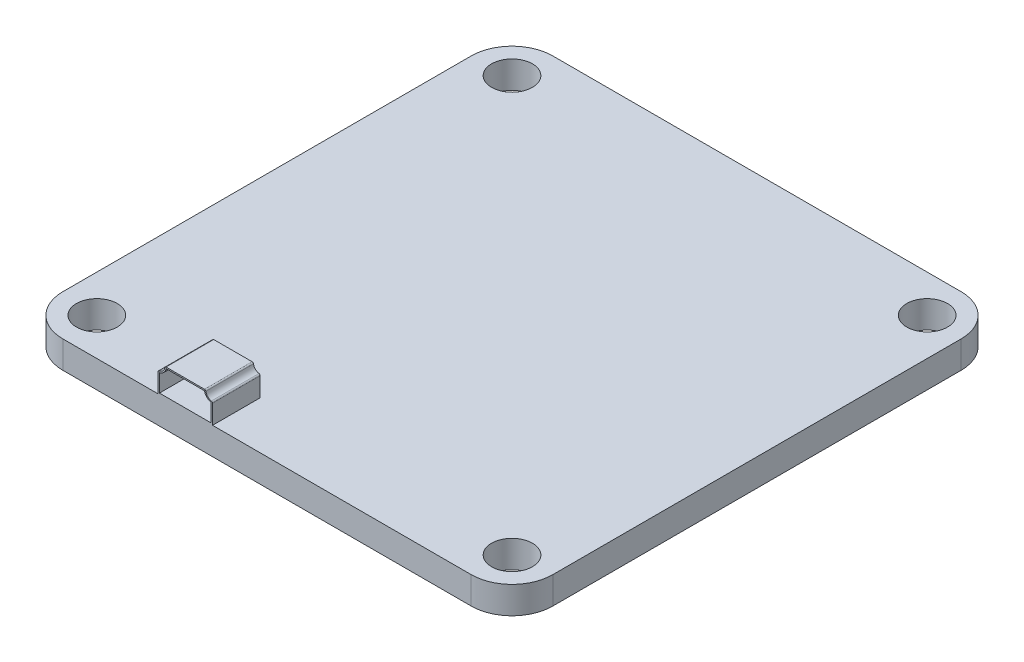
ISO-10303-21;
HEADER;
FILE_DESCRIPTION(('STEP AP214'),'2;1');
FILE_NAME('part.step','',(''),(''),'','','');
FILE_SCHEMA(('AUTOMOTIVE_DESIGN { 1 0 10303 214 1 1 1 1 }'));
ENDSEC;
DATA;
#1=APPLICATION_CONTEXT('core data for automotive mechanical design processes');
#2=APPLICATION_PROTOCOL_DEFINITION('international standard','automotive_design',2000,#1);
#3=PRODUCT_CONTEXT('',#1,'mechanical');
#4=PRODUCT('Part','Part','',(#3));
#5=PRODUCT_RELATED_PRODUCT_CATEGORY('part','',(#4));
#6=PRODUCT_DEFINITION_FORMATION('','',#4);
#7=PRODUCT_DEFINITION_CONTEXT('part definition',#1,'design');
#8=PRODUCT_DEFINITION('design','',#6,#7);
#9=PRODUCT_DEFINITION_SHAPE('','',#8);
#10=(LENGTH_UNIT() NAMED_UNIT(*) SI_UNIT(.MILLI.,.METRE.));
#11=(NAMED_UNIT(*) PLANE_ANGLE_UNIT() SI_UNIT($,.RADIAN.));
#12=(NAMED_UNIT(*) SI_UNIT($,.STERADIAN.) SOLID_ANGLE_UNIT());
#13=UNCERTAINTY_MEASURE_WITH_UNIT(LENGTH_MEASURE(1.E-05),#10,'distance_accuracy_value','');
#14=(GEOMETRIC_REPRESENTATION_CONTEXT(3) GLOBAL_UNCERTAINTY_ASSIGNED_CONTEXT((#13)) GLOBAL_UNIT_ASSIGNED_CONTEXT((#10,
#11,#12)) REPRESENTATION_CONTEXT('',''));
#15=CARTESIAN_POINT('',(0.,0.,0.));
#16=DIRECTION('',(0.,0.,1.));
#17=DIRECTION('',(1.,0.,0.));
#18=AXIS2_PLACEMENT_3D('',#15,#16,#17);
#19=CARTESIAN_POINT('',(-7.40839202169003,2.9,14.5));
#20=DIRECTION('',(0.,1.,0.));
#21=DIRECTION('',(0.,0.,1.));
#22=AXIS2_PLACEMENT_3D('',#19,#20,#21);
#23=PLANE('',#22);
#24=DIRECTION('',(-1.,0.,0.));
#25=VECTOR('',#24,1.);
#26=CARTESIAN_POINT('',(-7.40839202169003,2.9,15.));
#27=LINE('',#26,#25);
#28=CARTESIAN_POINT('',(-4.59160797830996,2.9,15.));
#29=VERTEX_POINT('',#28);
#30=CARTESIAN_POINT('',(-7.40839202169003,2.9,15.));
#31=VERTEX_POINT('',#30);
#32=EDGE_CURVE('E55',#29,#31,#27,.T.);
#33=ORIENTED_EDGE('',*,*,#32,.F.);
#34=DIRECTION('',(0.,0.,1.));
#35=VECTOR('',#34,1.);
#36=CARTESIAN_POINT('',(-4.59160797830996,2.9,14.5));
#37=LINE('',#36,#35);
#38=CARTESIAN_POINT('',(-4.59160797830996,2.9,18.));
#39=VERTEX_POINT('',#38);
#40=EDGE_CURVE('E253',#29,#39,#37,.T.);
#41=ORIENTED_EDGE('',*,*,#40,.T.);
#42=DIRECTION('',(-1.,0.,0.));
#43=VECTOR('',#42,1.);
#44=CARTESIAN_POINT('',(-7.40839202169003,2.9,18.));
#45=LINE('',#44,#43);
#46=CARTESIAN_POINT('',(-7.40839202169003,2.9,18.));
#47=VERTEX_POINT('',#46);
#48=EDGE_CURVE('E226',#39,#47,#45,.T.);
#49=ORIENTED_EDGE('',*,*,#48,.T.);
#50=DIRECTION('',(0.,0.,1.));
#51=VECTOR('',#50,1.);
#52=CARTESIAN_POINT('',(-7.40839202169003,2.9,14.5));
#53=LINE('',#52,#51);
#54=EDGE_CURVE('E211',#31,#47,#53,.T.);
#55=ORIENTED_EDGE('',*,*,#54,.F.);
#56=EDGE_LOOP('',(#33,#41,#49,#55));
#57=FACE_BOUND('',#56,.T.);
#58=ADVANCED_FACE('F39',(#57),#23,.F.);
#59=CARTESIAN_POINT('',(-3.99999999999999,3.,14.5));
#60=DIRECTION('',(0.,0.,1.));
#61=DIRECTION('',(1.,0.,0.));
#62=AXIS2_PLACEMENT_3D('',#59,#60,#61);
#63=CYLINDRICAL_SURFACE('',#62,0.6);
#64=CARTESIAN_POINT('',(-3.99999999999999,3.,15.));
#65=DIRECTION('',(0.,0.,-1.));
#66=DIRECTION('',(-1.,0.,0.));
#67=AXIS2_PLACEMENT_3D('',#64,#65,#66);
#68=CIRCLE('',#67,0.6);
#69=CARTESIAN_POINT('',(-4.1,2.40839202169004,15.));
#70=VERTEX_POINT('',#69);
#71=EDGE_CURVE('E62',#70,#29,#68,.T.);
#72=ORIENTED_EDGE('',*,*,#71,.F.);
#73=DIRECTION('',(0.,0.,1.));
#74=VECTOR('',#73,1.);
#75=CARTESIAN_POINT('',(-4.1,2.40839202169004,14.5));
#76=LINE('',#75,#74);
#77=CARTESIAN_POINT('',(-4.1,2.40839202169004,18.));
#78=VERTEX_POINT('',#77);
#79=EDGE_CURVE('E257',#70,#78,#76,.T.);
#80=ORIENTED_EDGE('',*,*,#79,.T.);
#81=CARTESIAN_POINT('',(-3.99999999999999,3.,18.));
#82=DIRECTION('',(0.,0.,-1.));
#83=DIRECTION('',(1.,0.,0.));
#84=AXIS2_PLACEMENT_3D('',#81,#82,#83);
#85=CIRCLE('',#84,0.6);
#86=EDGE_CURVE('E249',#78,#39,#85,.T.);
#87=ORIENTED_EDGE('',*,*,#86,.T.);
#88=ORIENTED_EDGE('',*,*,#40,.F.);
#89=EDGE_LOOP('',(#72,#80,#87,#88));
#90=FACE_BOUND('',#89,.T.);
#91=ADVANCED_FACE('F574',(#90),#63,.T.);
#92=CARTESIAN_POINT('',(-4.1,1.1,14.5));
#93=DIRECTION('',(1.,0.,0.));
#94=DIRECTION('',(0.,1.,0.));
#95=AXIS2_PLACEMENT_3D('',#92,#93,#94);
#96=PLANE('',#95);
#97=DIRECTION('',(0.,1.,0.));
#98=VECTOR('',#97,1.);
#99=CARTESIAN_POINT('',(-4.1,1.1,15.));
#100=LINE('',#99,#98);
#101=CARTESIAN_POINT('',(-4.1,1.1,15.));
#102=VERTEX_POINT('',#101);
#103=EDGE_CURVE('E232',#102,#70,#100,.T.);
#104=ORIENTED_EDGE('',*,*,#103,.F.);
#105=DIRECTION('',(0.,0.,1.));
#106=VECTOR('',#105,1.);
#107=CARTESIAN_POINT('',(-4.1,1.1,14.5));
#108=LINE('',#107,#106);
#109=CARTESIAN_POINT('',(-4.1,1.1,18.));
#110=VERTEX_POINT('',#109);
#111=EDGE_CURVE('E260',#102,#110,#108,.T.);
#112=ORIENTED_EDGE('',*,*,#111,.T.);
#113=DIRECTION('',(0.,1.,0.));
#114=VECTOR('',#113,1.);
#115=CARTESIAN_POINT('',(-4.1,1.1,18.));
#116=LINE('',#115,#114);
#117=EDGE_CURVE('E245',#110,#78,#116,.T.);
#118=ORIENTED_EDGE('',*,*,#117,.T.);
#119=ORIENTED_EDGE('',*,*,#79,.F.);
#120=EDGE_LOOP('',(#104,#112,#118,#119));
#121=FACE_BOUND('',#120,.T.);
#122=ADVANCED_FACE('F579',(#121),#96,.F.);
#123=CARTESIAN_POINT('',(-7.9,1.1,14.5));
#124=DIRECTION('',(0.,-1.,0.));
#125=DIRECTION('',(0.,0.,-1.));
#126=AXIS2_PLACEMENT_3D('',#123,#124,#125);
#127=PLANE('',#126);
#128=DIRECTION('',(1.,0.,0.));
#129=VECTOR('',#128,1.);
#130=CARTESIAN_POINT('',(-7.9,1.1,15.));
#131=LINE('',#130,#129);
#132=CARTESIAN_POINT('',(-7.9,1.1,15.));
#133=VERTEX_POINT('',#132);
#134=EDGE_CURVE('E220',#133,#102,#131,.T.);
#135=ORIENTED_EDGE('',*,*,#134,.F.);
#136=DIRECTION('',(0.,0.,1.));
#137=VECTOR('',#136,1.);
#138=CARTESIAN_POINT('',(-7.9,1.1,14.5));
#139=LINE('',#138,#137);
#140=CARTESIAN_POINT('',(-7.9,1.1,18.));
#141=VERTEX_POINT('',#140);
#142=EDGE_CURVE('E210',#133,#141,#139,.T.);
#143=ORIENTED_EDGE('',*,*,#142,.T.);
#144=DIRECTION('',(1.,0.,0.));
#145=VECTOR('',#144,1.);
#146=CARTESIAN_POINT('',(-7.9,1.1,18.));
#147=LINE('',#146,#145);
#148=EDGE_CURVE('E241',#141,#110,#147,.T.);
#149=ORIENTED_EDGE('',*,*,#148,.T.);
#150=ORIENTED_EDGE('',*,*,#111,.F.);
#151=EDGE_LOOP('',(#135,#143,#149,#150));
#152=FACE_BOUND('',#151,.T.);
#153=ADVANCED_FACE('F760',(#152),#127,.F.);
#154=CARTESIAN_POINT('',(-7.9,1.1,14.5));
#155=DIRECTION('',(-1.,0.,0.));
#156=DIRECTION('',(0.,0.,1.));
#157=AXIS2_PLACEMENT_3D('',#154,#155,#156);
#158=PLANE('',#157);
#159=DIRECTION('',(0.,-1.,0.));
#160=VECTOR('',#159,1.);
#161=CARTESIAN_POINT('',(-7.9,1.1,15.));
#162=LINE('',#161,#160);
#163=CARTESIAN_POINT('',(-7.9,2.40839202169004,15.));
#164=VERTEX_POINT('',#163);
#165=EDGE_CURVE('E215',#164,#133,#162,.T.);
#166=ORIENTED_EDGE('',*,*,#165,.F.);
#167=DIRECTION('',(0.,0.,1.));
#168=VECTOR('',#167,1.);
#169=CARTESIAN_POINT('',(-7.9,2.40839202169004,14.5));
#170=LINE('',#169,#168);
#171=CARTESIAN_POINT('',(-7.9,2.40839202169004,18.));
#172=VERTEX_POINT('',#171);
#173=EDGE_CURVE('E201',#164,#172,#170,.T.);
#174=ORIENTED_EDGE('',*,*,#173,.T.);
#175=DIRECTION('',(0.,-1.,0.));
#176=VECTOR('',#175,1.);
#177=CARTESIAN_POINT('',(-7.9,1.1,18.));
#178=LINE('',#177,#176);
#179=EDGE_CURVE('E238',#172,#141,#178,.T.);
#180=ORIENTED_EDGE('',*,*,#179,.T.);
#181=ORIENTED_EDGE('',*,*,#142,.F.);
#182=EDGE_LOOP('',(#166,#174,#180,#181));
#183=FACE_BOUND('',#182,.T.);
#184=ADVANCED_FACE('F216',(#183),#158,.F.);
#185=CARTESIAN_POINT('',(-7.99999999999999,3.,14.5));
#186=DIRECTION('',(0.,0.,1.));
#187=DIRECTION('',(1.,0.,0.));
#188=AXIS2_PLACEMENT_3D('',#185,#186,#187);
#189=CYLINDRICAL_SURFACE('',#188,0.6);
#190=CARTESIAN_POINT('',(-7.99999999999999,3.,15.));
#191=DIRECTION('',(0.,0.,-1.));
#192=DIRECTION('',(-1.,0.,0.));
#193=AXIS2_PLACEMENT_3D('',#190,#191,#192);
#194=CIRCLE('',#193,0.6);
#195=EDGE_CURVE('E11',#31,#164,#194,.T.);
#196=ORIENTED_EDGE('',*,*,#195,.F.);
#197=ORIENTED_EDGE('',*,*,#54,.T.);
#198=CARTESIAN_POINT('',(-7.99999999999999,3.,18.));
#199=DIRECTION('',(0.,0.,-1.));
#200=DIRECTION('',(1.,0.,0.));
#201=AXIS2_PLACEMENT_3D('',#198,#199,#200);
#202=CIRCLE('',#201,0.6);
#203=EDGE_CURVE('E205',#47,#172,#202,.T.);
#204=ORIENTED_EDGE('',*,*,#203,.T.);
#205=ORIENTED_EDGE('',*,*,#173,.F.);
#206=EDGE_LOOP('',(#196,#197,#204,#205));
#207=FACE_BOUND('',#206,.T.);
#208=ADVANCED_FACE('F203',(#207),#189,.T.);
#209=CARTESIAN_POINT('',(-15.,1.,15.));
#210=DIRECTION('',(0.,-1.,0.));
#211=DIRECTION('',(0.,0.,-1.));
#212=AXIS2_PLACEMENT_3D('',#209,#210,#211);
#213=PLANE('',#212);
#214=CARTESIAN_POINT('',(-15.25,1.,15.25));
#215=DIRECTION('',(0.,1.,0.));
#216=DIRECTION('',(0.,0.,1.));
#217=AXIS2_PLACEMENT_3D('',#214,#215,#216);
#218=CIRCLE('',#217,1.5);
#219=CARTESIAN_POINT('',(-15.25,1.,16.75));
#220=VERTEX_POINT('',#219);
#221=EDGE_CURVE('E373',#220,#220,#218,.T.);
#222=ORIENTED_EDGE('',*,*,#221,.F.);
#223=EDGE_LOOP('',(#222));
#224=FACE_BOUND('',#223,.T.);
#225=CARTESIAN_POINT('',(15.25,1.,15.25));
#226=DIRECTION('',(0.,1.,0.));
#227=DIRECTION('',(0.,0.,-1.));
#228=AXIS2_PLACEMENT_3D('',#225,#226,#227);
#229=CIRCLE('',#228,1.5);
#230=CARTESIAN_POINT('',(15.25,1.,13.75));
#231=VERTEX_POINT('',#230);
#232=EDGE_CURVE('E381',#231,#231,#229,.T.);
#233=ORIENTED_EDGE('',*,*,#232,.F.);
#234=EDGE_LOOP('',(#233));
#235=FACE_BOUND('',#234,.T.);
#236=CARTESIAN_POINT('',(-15.25,1.,-15.25));
#237=DIRECTION('',(0.,1.,0.));
#238=DIRECTION('',(0.,0.,-1.));
#239=AXIS2_PLACEMENT_3D('',#236,#237,#238);
#240=CIRCLE('',#239,1.5);
#241=CARTESIAN_POINT('',(-15.25,1.,-16.75));
#242=VERTEX_POINT('',#241);
#243=EDGE_CURVE('E389',#242,#242,#240,.T.);
#244=ORIENTED_EDGE('',*,*,#243,.F.);
#245=EDGE_LOOP('',(#244));
#246=FACE_BOUND('',#245,.T.);
#247=CARTESIAN_POINT('',(15.25,1.,-15.25));
#248=DIRECTION('',(0.,1.,0.));
#249=DIRECTION('',(0.,0.,1.));
#250=AXIS2_PLACEMENT_3D('',#247,#248,#249);
#251=CIRCLE('',#250,1.5);
#252=CARTESIAN_POINT('',(15.25,1.,-13.75));
#253=VERTEX_POINT('',#252);
#254=EDGE_CURVE('E397',#253,#253,#251,.T.);
#255=ORIENTED_EDGE('',*,*,#254,.F.);
#256=EDGE_LOOP('',(#255));
#257=FACE_BOUND('',#256,.T.);
#258=DIRECTION('',(0.,0.,1.));
#259=VECTOR('',#258,1.);
#260=CARTESIAN_POINT('',(-7.99999999999999,1.,14.5));
#261=LINE('',#260,#259);
#262=CARTESIAN_POINT('',(-7.99999999999999,1.,14.5));
#263=VERTEX_POINT('',#262);
#264=CARTESIAN_POINT('',(-7.99999999999999,1.,18.));
#265=VERTEX_POINT('',#264);
#266=EDGE_CURVE('E308',#263,#265,#261,.T.);
#267=ORIENTED_EDGE('',*,*,#266,.F.);
#268=DIRECTION('',(1.,0.,0.));
#269=VECTOR('',#268,1.);
#270=CARTESIAN_POINT('',(-7.99999999999999,1.,14.5));
#271=LINE('',#270,#269);
#272=CARTESIAN_POINT('',(-3.99999999999999,1.,14.5));
#273=VERTEX_POINT('',#272);
#274=EDGE_CURVE('E271',#263,#273,#271,.T.);
#275=ORIENTED_EDGE('',*,*,#274,.T.);
#276=DIRECTION('',(0.,0.,1.));
#277=VECTOR('',#276,1.);
#278=CARTESIAN_POINT('',(-3.99999999999999,1.,14.5));
#279=LINE('',#278,#277);
#280=CARTESIAN_POINT('',(-3.99999999999999,1.,18.));
#281=VERTEX_POINT('',#280);
#282=EDGE_CURVE('E368',#273,#281,#279,.T.);
#283=ORIENTED_EDGE('',*,*,#282,.T.);
#284=DIRECTION('',(1.,0.,0.));
#285=VECTOR('',#284,1.);
#286=CARTESIAN_POINT('',(-15.,1.,18.));
#287=LINE('',#286,#285);
#288=CARTESIAN_POINT('',(15.,1.,18.));
#289=VERTEX_POINT('',#288);
#290=EDGE_CURVE('E409',#281,#289,#287,.T.);
#291=ORIENTED_EDGE('',*,*,#290,.T.);
#292=CARTESIAN_POINT('',(15.,1.,15.));
#293=DIRECTION('',(0.,1.,0.));
#294=DIRECTION('',(0.,0.,1.));
#295=AXIS2_PLACEMENT_3D('',#292,#293,#294);
#296=CIRCLE('',#295,3.);
#297=CARTESIAN_POINT('',(18.,1.,15.));
#298=VERTEX_POINT('',#297);
#299=EDGE_CURVE('E415',#289,#298,#296,.T.);
#300=ORIENTED_EDGE('',*,*,#299,.T.);
#301=DIRECTION('',(0.,0.,-1.));
#302=VECTOR('',#301,1.);
#303=CARTESIAN_POINT('',(18.,1.,15.));
#304=LINE('',#303,#302);
#305=CARTESIAN_POINT('',(18.,1.,-15.));
#306=VERTEX_POINT('',#305);
#307=EDGE_CURVE('E418',#298,#306,#304,.T.);
#308=ORIENTED_EDGE('',*,*,#307,.T.);
#309=CARTESIAN_POINT('',(15.,1.,-15.));
#310=DIRECTION('',(0.,1.,0.));
#311=DIRECTION('',(0.,0.,-1.));
#312=AXIS2_PLACEMENT_3D('',#309,#310,#311);
#313=CIRCLE('',#312,3.);
#314=CARTESIAN_POINT('',(15.,1.,-18.));
#315=VERTEX_POINT('',#314);
#316=EDGE_CURVE('E421',#306,#315,#313,.T.);
#317=ORIENTED_EDGE('',*,*,#316,.T.);
#318=DIRECTION('',(-1.,0.,0.));
#319=VECTOR('',#318,1.);
#320=CARTESIAN_POINT('',(-15.,1.,-18.));
#321=LINE('',#320,#319);
#322=CARTESIAN_POINT('',(-15.,1.,-18.));
#323=VERTEX_POINT('',#322);
#324=EDGE_CURVE('E424',#315,#323,#321,.T.);
#325=ORIENTED_EDGE('',*,*,#324,.T.);
#326=CARTESIAN_POINT('',(-15.,1.,-15.));
#327=DIRECTION('',(0.,1.,0.));
#328=DIRECTION('',(0.,0.,-1.));
#329=AXIS2_PLACEMENT_3D('',#326,#327,#328);
#330=CIRCLE('',#329,3.);
#331=CARTESIAN_POINT('',(-18.,1.,-15.));
#332=VERTEX_POINT('',#331);
#333=EDGE_CURVE('E427',#323,#332,#330,.T.);
#334=ORIENTED_EDGE('',*,*,#333,.T.);
#335=DIRECTION('',(0.,0.,1.));
#336=VECTOR('',#335,1.);
#337=CARTESIAN_POINT('',(-18.,1.,15.));
#338=LINE('',#337,#336);
#339=CARTESIAN_POINT('',(-18.,1.,15.));
#340=VERTEX_POINT('',#339);
#341=EDGE_CURVE('E430',#332,#340,#338,.T.);
#342=ORIENTED_EDGE('',*,*,#341,.T.);
#343=CARTESIAN_POINT('',(-15.,1.,15.));
#344=DIRECTION('',(0.,1.,0.));
#345=DIRECTION('',(0.,0.,-1.));
#346=AXIS2_PLACEMENT_3D('',#343,#344,#345);
#347=CIRCLE('',#346,3.);
#348=CARTESIAN_POINT('',(-15.,1.,18.));
#349=VERTEX_POINT('',#348);
#350=EDGE_CURVE('E405',#340,#349,#347,.T.);
#351=ORIENTED_EDGE('',*,*,#350,.T.);
#352=EDGE_CURVE('E411',#349,#265,#287,.T.);
#353=ORIENTED_EDGE('',*,*,#352,.T.);
#354=EDGE_LOOP('',(#267,#275,#283,#291,#300,#308,#317,#325,#334,#342,#351,#353));
#355=FACE_BOUND('',#354,.T.);
#356=ADVANCED_FACE('F513',(#224,#235,#246,#257,#355),#213,.F.);
#357=CARTESIAN_POINT('',(-15.,-1.,15.));
#358=DIRECTION('',(0.,-1.,0.));
#359=DIRECTION('',(0.,0.,-1.));
#360=AXIS2_PLACEMENT_3D('',#357,#358,#359);
#361=PLANE('',#360);
#362=CARTESIAN_POINT('',(15.25,-1.,15.25));
#363=DIRECTION('',(0.,1.,0.));
#364=DIRECTION('',(0.,0.,-1.));
#365=AXIS2_PLACEMENT_3D('',#362,#363,#364);
#366=CIRCLE('',#365,1.5);
#367=CARTESIAN_POINT('',(15.25,-1.,13.75));
#368=VERTEX_POINT('',#367);
#369=EDGE_CURVE('E377',#368,#368,#366,.T.);
#370=ORIENTED_EDGE('',*,*,#369,.T.);
#371=EDGE_LOOP('',(#370));
#372=FACE_BOUND('',#371,.T.);
#373=CARTESIAN_POINT('',(15.25,-1.,-15.25));
#374=DIRECTION('',(0.,1.,0.));
#375=DIRECTION('',(0.,0.,1.));
#376=AXIS2_PLACEMENT_3D('',#373,#374,#375);
#377=CIRCLE('',#376,1.5);
#378=CARTESIAN_POINT('',(15.25,-1.,-13.75));
#379=VERTEX_POINT('',#378);
#380=EDGE_CURVE('E393',#379,#379,#377,.T.);
#381=ORIENTED_EDGE('',*,*,#380,.T.);
#382=EDGE_LOOP('',(#381));
#383=FACE_BOUND('',#382,.T.);
#384=CARTESIAN_POINT('',(-15.,-1.,15.));
#385=DIRECTION('',(0.,1.,0.));
#386=DIRECTION('',(0.,0.,-1.));
#387=AXIS2_PLACEMENT_3D('',#384,#385,#386);
#388=CIRCLE('',#387,3.);
#389=CARTESIAN_POINT('',(-18.,-1.,15.));
#390=VERTEX_POINT('',#389);
#391=CARTESIAN_POINT('',(-15.,-1.,18.));
#392=VERTEX_POINT('',#391);
#393=EDGE_CURVE('E401',#390,#392,#388,.T.);
#394=ORIENTED_EDGE('',*,*,#393,.F.);
#395=DIRECTION('',(0.,0.,1.));
#396=VECTOR('',#395,1.);
#397=CARTESIAN_POINT('',(-18.,-1.,15.));
#398=LINE('',#397,#396);
#399=CARTESIAN_POINT('',(-18.,-1.,-15.));
#400=VERTEX_POINT('',#399);
#401=EDGE_CURVE('E410',#400,#390,#398,.T.);
#402=ORIENTED_EDGE('',*,*,#401,.F.);
#403=CARTESIAN_POINT('',(-15.,-1.,-15.));
#404=DIRECTION('',(0.,1.,0.));
#405=DIRECTION('',(0.,0.,-1.));
#406=AXIS2_PLACEMENT_3D('',#403,#404,#405);
#407=CIRCLE('',#406,3.);
#408=CARTESIAN_POINT('',(-15.,-1.,-18.));
#409=VERTEX_POINT('',#408);
#410=EDGE_CURVE('E452',#409,#400,#407,.T.);
#411=ORIENTED_EDGE('',*,*,#410,.F.);
#412=DIRECTION('',(-1.,0.,0.));
#413=VECTOR('',#412,1.);
#414=CARTESIAN_POINT('',(-15.,-1.,-18.));
#415=LINE('',#414,#413);
#416=CARTESIAN_POINT('',(15.,-1.,-18.));
#417=VERTEX_POINT('',#416);
#418=EDGE_CURVE('E449',#417,#409,#415,.T.);
#419=ORIENTED_EDGE('',*,*,#418,.F.);
#420=CARTESIAN_POINT('',(15.,-1.,-15.));
#421=DIRECTION('',(0.,1.,0.));
#422=DIRECTION('',(0.,0.,-1.));
#423=AXIS2_PLACEMENT_3D('',#420,#421,#422);
#424=CIRCLE('',#423,3.);
#425=CARTESIAN_POINT('',(18.,-1.,-15.));
#426=VERTEX_POINT('',#425);
#427=EDGE_CURVE('E446',#426,#417,#424,.T.);
#428=ORIENTED_EDGE('',*,*,#427,.F.);
#429=DIRECTION('',(0.,0.,-1.));
#430=VECTOR('',#429,1.);
#431=CARTESIAN_POINT('',(18.,-1.,15.));
#432=LINE('',#431,#430);
#433=CARTESIAN_POINT('',(18.,-1.,15.));
#434=VERTEX_POINT('',#433);
#435=EDGE_CURVE('E443',#434,#426,#432,.T.);
#436=ORIENTED_EDGE('',*,*,#435,.F.);
#437=CARTESIAN_POINT('',(15.,-1.,15.));
#438=DIRECTION('',(0.,1.,0.));
#439=DIRECTION('',(0.,0.,1.));
#440=AXIS2_PLACEMENT_3D('',#437,#438,#439);
#441=CIRCLE('',#440,3.);
#442=CARTESIAN_POINT('',(15.,-1.,18.));
#443=VERTEX_POINT('',#442);
#444=EDGE_CURVE('E440',#443,#434,#441,.T.);
#445=ORIENTED_EDGE('',*,*,#444,.F.);
#446=DIRECTION('',(1.,0.,0.));
#447=VECTOR('',#446,1.);
#448=CARTESIAN_POINT('',(-15.,-1.,18.));
#449=LINE('',#448,#447);
#450=EDGE_CURVE('E437',#392,#443,#449,.T.);
#451=ORIENTED_EDGE('',*,*,#450,.F.);
#452=EDGE_LOOP('',(#394,#402,#411,#419,#428,#436,#445,#451));
#453=FACE_BOUND('',#452,.T.);
#454=CARTESIAN_POINT('',(-15.25,-1.,-15.25));
#455=DIRECTION('',(0.,1.,0.));
#456=DIRECTION('',(0.,0.,-1.));
#457=AXIS2_PLACEMENT_3D('',#454,#455,#456);
#458=CIRCLE('',#457,1.5);
#459=CARTESIAN_POINT('',(-15.25,-1.,-16.75));
#460=VERTEX_POINT('',#459);
#461=EDGE_CURVE('E385',#460,#460,#458,.T.);
#462=ORIENTED_EDGE('',*,*,#461,.T.);
#463=EDGE_LOOP('',(#462));
#464=FACE_BOUND('',#463,.T.);
#465=CARTESIAN_POINT('',(-15.25,-1.,15.25));
#466=DIRECTION('',(0.,1.,0.));
#467=DIRECTION('',(0.,0.,1.));
#468=AXIS2_PLACEMENT_3D('',#465,#466,#467);
#469=CIRCLE('',#468,1.5);
#470=CARTESIAN_POINT('',(-15.25,-1.,16.75));
#471=VERTEX_POINT('',#470);
#472=EDGE_CURVE('E346',#471,#471,#469,.T.);
#473=ORIENTED_EDGE('',*,*,#472,.T.);
#474=EDGE_LOOP('',(#473));
#475=FACE_BOUND('',#474,.T.);
#476=ADVANCED_FACE('F496',(#372,#383,#453,#464,#475),#361,.T.);
#477=CARTESIAN_POINT('',(-15.,1.,15.));
#478=DIRECTION('',(0.,-1.,0.));
#479=DIRECTION('',(0.,0.,-1.));
#480=AXIS2_PLACEMENT_3D('',#477,#478,#479);
#481=CYLINDRICAL_SURFACE('',#480,3.);
#482=ORIENTED_EDGE('',*,*,#393,.T.);
#483=DIRECTION('',(0.,-1.,0.));
#484=VECTOR('',#483,1.);
#485=CARTESIAN_POINT('',(-15.,1.,18.));
#486=LINE('',#485,#484);
#487=EDGE_CURVE('E48',#349,#392,#486,.T.);
#488=ORIENTED_EDGE('',*,*,#487,.F.);
#489=ORIENTED_EDGE('',*,*,#350,.F.);
#490=DIRECTION('',(0.,-1.,0.));
#491=VECTOR('',#490,1.);
#492=CARTESIAN_POINT('',(-18.,1.,15.));
#493=LINE('',#492,#491);
#494=EDGE_CURVE('E433',#340,#390,#493,.T.);
#495=ORIENTED_EDGE('',*,*,#494,.T.);
#496=EDGE_LOOP('',(#482,#488,#489,#495));
#497=FACE_BOUND('',#496,.T.);
#498=ADVANCED_FACE('F41',(#497),#481,.T.);
#499=CARTESIAN_POINT('',(-15.,1.,18.));
#500=DIRECTION('',(0.,0.,-1.));
#501=DIRECTION('',(-1.,0.,0.));
#502=AXIS2_PLACEMENT_3D('',#499,#500,#501);
#503=PLANE('',#502);
#504=ORIENTED_EDGE('',*,*,#450,.T.);
#505=DIRECTION('',(0.,-1.,0.));
#506=VECTOR('',#505,1.);
#507=CARTESIAN_POINT('',(15.,1.,18.));
#508=LINE('',#507,#506);
#509=EDGE_CURVE('E480',#289,#443,#508,.T.);
#510=ORIENTED_EDGE('',*,*,#509,.F.);
#511=ORIENTED_EDGE('',*,*,#290,.F.);
#512=DIRECTION('',(0.,1.,0.));
#513=VECTOR('',#512,1.);
#514=CARTESIAN_POINT('',(-3.99999999999999,1.,18.));
#515=LINE('',#514,#513);
#516=CARTESIAN_POINT('',(-3.99999999999999,2.40839202169004,18.));
#517=VERTEX_POINT('',#516);
#518=EDGE_CURVE('E312',#281,#517,#515,.T.);
#519=ORIENTED_EDGE('',*,*,#518,.T.);
#520=CARTESIAN_POINT('',(-4.1,2.40839202169004,18.));
#521=DIRECTION('',(0.,0.,1.));
#522=DIRECTION('',(-1.,0.,0.));
#523=AXIS2_PLACEMENT_3D('',#520,#521,#522);
#524=CIRCLE('',#523,0.1);
#525=CARTESIAN_POINT('',(-4.08333333333333,2.50699335140837,18.));
#526=VERTEX_POINT('',#525);
#527=EDGE_CURVE('E316',#517,#526,#524,.T.);
#528=ORIENTED_EDGE('',*,*,#527,.T.);
#529=CARTESIAN_POINT('',(-3.99999999999999,3.,18.));
#530=DIRECTION('',(0.,0.,-1.));
#531=DIRECTION('',(1.,0.,0.));
#532=AXIS2_PLACEMENT_3D('',#529,#530,#531);
#533=CIRCLE('',#532,0.5);
#534=CARTESIAN_POINT('',(-4.49300664859163,2.91666666666667,18.));
#535=VERTEX_POINT('',#534);
#536=EDGE_CURVE('E320',#526,#535,#533,.T.);
#537=ORIENTED_EDGE('',*,*,#536,.T.);
#538=CARTESIAN_POINT('',(-4.59160797830996,2.9,18.));
#539=DIRECTION('',(0.,0.,1.));
#540=DIRECTION('',(1.,0.,0.));
#541=AXIS2_PLACEMENT_3D('',#538,#539,#540);
#542=CIRCLE('',#541,0.0999999999999998);
#543=CARTESIAN_POINT('',(-4.59160797830996,3.,18.));
#544=VERTEX_POINT('',#543);
#545=EDGE_CURVE('E324',#535,#544,#542,.T.);
#546=ORIENTED_EDGE('',*,*,#545,.T.);
#547=DIRECTION('',(-1.,0.,0.));
#548=VECTOR('',#547,1.);
#549=CARTESIAN_POINT('',(-7.40839202169003,3.,18.));
#550=LINE('',#549,#548);
#551=CARTESIAN_POINT('',(-7.40839202169003,3.,18.));
#552=VERTEX_POINT('',#551);
#553=EDGE_CURVE('E328',#544,#552,#550,.T.);
#554=ORIENTED_EDGE('',*,*,#553,.T.);
#555=CARTESIAN_POINT('',(-7.40839202169003,2.9,18.));
#556=DIRECTION('',(0.,0.,1.));
#557=DIRECTION('',(-1.,0.,0.));
#558=AXIS2_PLACEMENT_3D('',#555,#556,#557);
#559=CIRCLE('',#558,0.0999999999999998);
#560=CARTESIAN_POINT('',(-7.50699335140836,2.91666666666667,18.));
#561=VERTEX_POINT('',#560);
#562=EDGE_CURVE('E332',#552,#561,#559,.T.);
#563=ORIENTED_EDGE('',*,*,#562,.T.);
#564=CARTESIAN_POINT('',(-7.99999999999999,3.,18.));
#565=DIRECTION('',(0.,0.,-1.));
#566=DIRECTION('',(1.,0.,0.));
#567=AXIS2_PLACEMENT_3D('',#564,#565,#566);
#568=CIRCLE('',#567,0.5);
#569=CARTESIAN_POINT('',(-7.91666666666666,2.50699335140837,18.));
#570=VERTEX_POINT('',#569);
#571=EDGE_CURVE('E336',#561,#570,#568,.T.);
#572=ORIENTED_EDGE('',*,*,#571,.T.);
#573=CARTESIAN_POINT('',(-7.9,2.40839202169004,18.));
#574=DIRECTION('',(0.,0.,1.));
#575=DIRECTION('',(1.,0.,0.));
#576=AXIS2_PLACEMENT_3D('',#573,#574,#575);
#577=CIRCLE('',#576,0.0999999999999998);
#578=CARTESIAN_POINT('',(-7.99999999999999,2.40839202169004,18.));
#579=VERTEX_POINT('',#578);
#580=EDGE_CURVE('E272',#570,#579,#577,.T.);
#581=ORIENTED_EDGE('',*,*,#580,.T.);
#582=DIRECTION('',(0.,-1.,0.));
#583=VECTOR('',#582,1.);
#584=CARTESIAN_POINT('',(-7.99999999999999,1.,18.));
#585=LINE('',#584,#583);
#586=EDGE_CURVE('E256',#579,#265,#585,.T.);
#587=ORIENTED_EDGE('',*,*,#586,.T.);
#588=ORIENTED_EDGE('',*,*,#352,.F.);
#589=ORIENTED_EDGE('',*,*,#487,.T.);
#590=EDGE_LOOP('',(#504,#510,#511,#519,#528,#537,#546,#554,#563,#572,#581,#587,#588,#589));
#591=FACE_BOUND('',#590,.T.);
#592=ORIENTED_EDGE('',*,*,#48,.F.);
#593=ORIENTED_EDGE('',*,*,#86,.F.);
#594=ORIENTED_EDGE('',*,*,#117,.F.);
#595=ORIENTED_EDGE('',*,*,#148,.F.);
#596=ORIENTED_EDGE('',*,*,#179,.F.);
#597=ORIENTED_EDGE('',*,*,#203,.F.);
#598=EDGE_LOOP('',(#592,#593,#594,#595,#596,#597));
#599=FACE_BOUND('',#598,.T.);
#600=ADVANCED_FACE('F487',(#591,#599),#503,.F.);
#601=CARTESIAN_POINT('',(15.,1.,15.));
#602=DIRECTION('',(0.,-1.,0.));
#603=DIRECTION('',(0.,0.,-1.));
#604=AXIS2_PLACEMENT_3D('',#601,#602,#603);
#605=CYLINDRICAL_SURFACE('',#604,3.);
#606=ORIENTED_EDGE('',*,*,#444,.T.);
#607=DIRECTION('',(0.,-1.,0.));
#608=VECTOR('',#607,1.);
#609=CARTESIAN_POINT('',(18.,1.,15.));
#610=LINE('',#609,#608);
#611=EDGE_CURVE('E476',#298,#434,#610,.T.);
#612=ORIENTED_EDGE('',*,*,#611,.F.);
#613=ORIENTED_EDGE('',*,*,#299,.F.);
#614=ORIENTED_EDGE('',*,*,#509,.T.);
#615=EDGE_LOOP('',(#606,#612,#613,#614));
#616=FACE_BOUND('',#615,.T.);
#617=ADVANCED_FACE('F504',(#616),#605,.T.);
#618=CARTESIAN_POINT('',(18.,1.,15.));
#619=DIRECTION('',(-1.,0.,0.));
#620=DIRECTION('',(0.,0.,1.));
#621=AXIS2_PLACEMENT_3D('',#618,#619,#620);
#622=PLANE('',#621);
#623=ORIENTED_EDGE('',*,*,#435,.T.);
#624=DIRECTION('',(0.,-1.,0.));
#625=VECTOR('',#624,1.);
#626=CARTESIAN_POINT('',(18.,1.,-15.));
#627=LINE('',#626,#625);
#628=EDGE_CURVE('E472',#306,#426,#627,.T.);
#629=ORIENTED_EDGE('',*,*,#628,.F.);
#630=ORIENTED_EDGE('',*,*,#307,.F.);
#631=ORIENTED_EDGE('',*,*,#611,.T.);
#632=EDGE_LOOP('',(#623,#629,#630,#631));
#633=FACE_BOUND('',#632,.T.);
#634=ADVANCED_FACE('F508',(#633),#622,.F.);
#635=CARTESIAN_POINT('',(15.,1.,-15.));
#636=DIRECTION('',(0.,-1.,0.));
#637=DIRECTION('',(0.,0.,-1.));
#638=AXIS2_PLACEMENT_3D('',#635,#636,#637);
#639=CYLINDRICAL_SURFACE('',#638,3.);
#640=ORIENTED_EDGE('',*,*,#427,.T.);
#641=DIRECTION('',(0.,-1.,0.));
#642=VECTOR('',#641,1.);
#643=CARTESIAN_POINT('',(15.,1.,-18.));
#644=LINE('',#643,#642);
#645=EDGE_CURVE('E468',#315,#417,#644,.T.);
#646=ORIENTED_EDGE('',*,*,#645,.F.);
#647=ORIENTED_EDGE('',*,*,#316,.F.);
#648=ORIENTED_EDGE('',*,*,#628,.T.);
#649=EDGE_LOOP('',(#640,#646,#647,#648));
#650=FACE_BOUND('',#649,.T.);
#651=ADVANCED_FACE('F564',(#650),#639,.T.);
#652=CARTESIAN_POINT('',(-15.,1.,-18.));
#653=DIRECTION('',(0.,0.,1.));
#654=DIRECTION('',(1.,0.,0.));
#655=AXIS2_PLACEMENT_3D('',#652,#653,#654);
#656=PLANE('',#655);
#657=ORIENTED_EDGE('',*,*,#418,.T.);
#658=DIRECTION('',(0.,-1.,0.));
#659=VECTOR('',#658,1.);
#660=CARTESIAN_POINT('',(-15.,1.,-18.));
#661=LINE('',#660,#659);
#662=EDGE_CURVE('E464',#323,#409,#661,.T.);
#663=ORIENTED_EDGE('',*,*,#662,.F.);
#664=ORIENTED_EDGE('',*,*,#324,.F.);
#665=ORIENTED_EDGE('',*,*,#645,.T.);
#666=EDGE_LOOP('',(#657,#663,#664,#665));
#667=FACE_BOUND('',#666,.T.);
#668=ADVANCED_FACE('F561',(#667),#656,.F.);
#669=CARTESIAN_POINT('',(-15.,1.,-15.));
#670=DIRECTION('',(0.,-1.,0.));
#671=DIRECTION('',(0.,0.,-1.));
#672=AXIS2_PLACEMENT_3D('',#669,#670,#671);
#673=CYLINDRICAL_SURFACE('',#672,3.);
#674=ORIENTED_EDGE('',*,*,#410,.T.);
#675=DIRECTION('',(0.,-1.,0.));
#676=VECTOR('',#675,1.);
#677=CARTESIAN_POINT('',(-18.,1.,-15.));
#678=LINE('',#677,#676);
#679=EDGE_CURVE('E460',#332,#400,#678,.T.);
#680=ORIENTED_EDGE('',*,*,#679,.F.);
#681=ORIENTED_EDGE('',*,*,#333,.F.);
#682=ORIENTED_EDGE('',*,*,#662,.T.);
#683=EDGE_LOOP('',(#674,#680,#681,#682));
#684=FACE_BOUND('',#683,.T.);
#685=ADVANCED_FACE('F557',(#684),#673,.T.);
#686=CARTESIAN_POINT('',(-18.,1.,15.));
#687=DIRECTION('',(1.,0.,0.));
#688=DIRECTION('',(0.,0.,-1.));
#689=AXIS2_PLACEMENT_3D('',#686,#687,#688);
#690=PLANE('',#689);
#691=ORIENTED_EDGE('',*,*,#401,.T.);
#692=ORIENTED_EDGE('',*,*,#494,.F.);
#693=ORIENTED_EDGE('',*,*,#341,.F.);
#694=ORIENTED_EDGE('',*,*,#679,.T.);
#695=EDGE_LOOP('',(#691,#692,#693,#694));
#696=FACE_BOUND('',#695,.T.);
#697=ADVANCED_FACE('F555',(#696),#690,.F.);
#698=CARTESIAN_POINT('',(15.25,1.,-15.25));
#699=DIRECTION('',(0.,-1.,0.));
#700=DIRECTION('',(0.,0.,-1.));
#701=AXIS2_PLACEMENT_3D('',#698,#699,#700);
#702=CYLINDRICAL_SURFACE('',#701,1.5);
#703=ORIENTED_EDGE('',*,*,#254,.T.);
#704=EDGE_LOOP('',(#703));
#705=FACE_BOUND('',#704,.T.);
#706=ORIENTED_EDGE('',*,*,#380,.F.);
#707=EDGE_LOOP('',(#706));
#708=FACE_BOUND('',#707,.T.);
#709=ADVANCED_FACE('F618',(#705,#708),#702,.F.);
#710=CARTESIAN_POINT('',(-15.25,1.,-15.25));
#711=DIRECTION('',(0.,-1.,0.));
#712=DIRECTION('',(0.,0.,-1.));
#713=AXIS2_PLACEMENT_3D('',#710,#711,#712);
#714=CYLINDRICAL_SURFACE('',#713,1.5);
#715=ORIENTED_EDGE('',*,*,#243,.T.);
#716=EDGE_LOOP('',(#715));
#717=FACE_BOUND('',#716,.T.);
#718=ORIENTED_EDGE('',*,*,#461,.F.);
#719=EDGE_LOOP('',(#718));
#720=FACE_BOUND('',#719,.T.);
#721=ADVANCED_FACE('F614',(#717,#720),#714,.F.);
#722=CARTESIAN_POINT('',(15.25,1.,15.25));
#723=DIRECTION('',(0.,-1.,0.));
#724=DIRECTION('',(0.,0.,-1.));
#725=AXIS2_PLACEMENT_3D('',#722,#723,#724);
#726=CYLINDRICAL_SURFACE('',#725,1.5);
#727=ORIENTED_EDGE('',*,*,#232,.T.);
#728=EDGE_LOOP('',(#727));
#729=FACE_BOUND('',#728,.T.);
#730=ORIENTED_EDGE('',*,*,#369,.F.);
#731=EDGE_LOOP('',(#730));
#732=FACE_BOUND('',#731,.T.);
#733=ADVANCED_FACE('F610',(#729,#732),#726,.F.);
#734=CARTESIAN_POINT('',(-15.25,1.,15.25));
#735=DIRECTION('',(0.,-1.,0.));
#736=DIRECTION('',(0.,0.,-1.));
#737=AXIS2_PLACEMENT_3D('',#734,#735,#736);
#738=CYLINDRICAL_SURFACE('',#737,1.5);
#739=ORIENTED_EDGE('',*,*,#221,.T.);
#740=EDGE_LOOP('',(#739));
#741=FACE_BOUND('',#740,.T.);
#742=ORIENTED_EDGE('',*,*,#472,.F.);
#743=EDGE_LOOP('',(#742));
#744=FACE_BOUND('',#743,.T.);
#745=ADVANCED_FACE('F607',(#741,#744),#738,.F.);
#746=CARTESIAN_POINT('',(-7.99999999999999,1.,14.5));
#747=DIRECTION('',(-1.,0.,0.));
#748=DIRECTION('',(0.,0.,1.));
#749=AXIS2_PLACEMENT_3D('',#746,#747,#748);
#750=PLANE('',#749);
#751=ORIENTED_EDGE('',*,*,#266,.T.);
#752=ORIENTED_EDGE('',*,*,#586,.F.);
#753=DIRECTION('',(0.,0.,1.));
#754=VECTOR('',#753,1.);
#755=CARTESIAN_POINT('',(-7.99999999999999,2.40839202169004,14.5));
#756=LINE('',#755,#754);
#757=CARTESIAN_POINT('',(-7.99999999999999,2.40839202169004,14.5));
#758=VERTEX_POINT('',#757);
#759=EDGE_CURVE('E343',#758,#579,#756,.T.);
#760=ORIENTED_EDGE('',*,*,#759,.F.);
#761=DIRECTION('',(0.,-1.,0.));
#762=VECTOR('',#761,1.);
#763=CARTESIAN_POINT('',(-7.99999999999999,1.,14.5));
#764=LINE('',#763,#762);
#765=EDGE_CURVE('E267',#758,#263,#764,.T.);
#766=ORIENTED_EDGE('',*,*,#765,.T.);
#767=EDGE_LOOP('',(#751,#752,#760,#766));
#768=FACE_BOUND('',#767,.T.);
#769=ADVANCED_FACE('F550',(#768),#750,.T.);
#770=CARTESIAN_POINT('',(-7.9,2.40839202169004,14.5));
#771=DIRECTION('',(0.,0.,1.));
#772=DIRECTION('',(1.,0.,0.));
#773=AXIS2_PLACEMENT_3D('',#770,#771,#772);
#774=CYLINDRICAL_SURFACE('',#773,0.0999999999999998);
#775=ORIENTED_EDGE('',*,*,#759,.T.);
#776=ORIENTED_EDGE('',*,*,#580,.F.);
#777=DIRECTION('',(0.,0.,1.));
#778=VECTOR('',#777,1.);
#779=CARTESIAN_POINT('',(-7.91666666666666,2.50699335140837,14.5));
#780=LINE('',#779,#778);
#781=CARTESIAN_POINT('',(-7.91666666666666,2.50699335140837,14.5));
#782=VERTEX_POINT('',#781);
#783=EDGE_CURVE('E347',#782,#570,#780,.T.);
#784=ORIENTED_EDGE('',*,*,#783,.F.);
#785=CARTESIAN_POINT('',(-7.9,2.40839202169004,14.5));
#786=DIRECTION('',(0.,0.,1.));
#787=DIRECTION('',(1.,0.,0.));
#788=AXIS2_PLACEMENT_3D('',#785,#786,#787);
#789=CIRCLE('',#788,0.0999999999999998);
#790=EDGE_CURVE('E304',#782,#758,#789,.T.);
#791=ORIENTED_EDGE('',*,*,#790,.T.);
#792=EDGE_LOOP('',(#775,#776,#784,#791));
#793=FACE_BOUND('',#792,.T.);
#794=ADVANCED_FACE('F545',(#793),#774,.T.);
#795=CARTESIAN_POINT('',(-7.99999999999999,3.,14.5));
#796=DIRECTION('',(0.,0.,1.));
#797=DIRECTION('',(1.,0.,0.));
#798=AXIS2_PLACEMENT_3D('',#795,#796,#797);
#799=CYLINDRICAL_SURFACE('',#798,0.5);
#800=ORIENTED_EDGE('',*,*,#783,.T.);
#801=ORIENTED_EDGE('',*,*,#571,.F.);
#802=DIRECTION('',(0.,0.,1.));
#803=VECTOR('',#802,1.);
#804=CARTESIAN_POINT('',(-7.50699335140836,2.91666666666667,14.5));
#805=LINE('',#804,#803);
#806=CARTESIAN_POINT('',(-7.50699335140836,2.91666666666667,14.5));
#807=VERTEX_POINT('',#806);
#808=EDGE_CURVE('E350',#807,#561,#805,.T.);
#809=ORIENTED_EDGE('',*,*,#808,.F.);
#810=CARTESIAN_POINT('',(-7.99999999999999,3.,14.5));
#811=DIRECTION('',(0.,0.,-1.));
#812=DIRECTION('',(1.,0.,0.));
#813=AXIS2_PLACEMENT_3D('',#810,#811,#812);
#814=CIRCLE('',#813,0.5);
#815=EDGE_CURVE('E300',#807,#782,#814,.T.);
#816=ORIENTED_EDGE('',*,*,#815,.T.);
#817=EDGE_LOOP('',(#800,#801,#809,#816));
#818=FACE_BOUND('',#817,.T.);
#819=ADVANCED_FACE('F590',(#818),#799,.F.);
#820=CARTESIAN_POINT('',(-7.40839202169003,2.9,14.5));
#821=DIRECTION('',(0.,0.,1.));
#822=DIRECTION('',(1.,0.,0.));
#823=AXIS2_PLACEMENT_3D('',#820,#821,#822);
#824=CYLINDRICAL_SURFACE('',#823,0.0999999999999998);
#825=ORIENTED_EDGE('',*,*,#808,.T.);
#826=ORIENTED_EDGE('',*,*,#562,.F.);
#827=DIRECTION('',(0.,0.,1.));
#828=VECTOR('',#827,1.);
#829=CARTESIAN_POINT('',(-7.40839202169003,3.,14.5));
#830=LINE('',#829,#828);
#831=CARTESIAN_POINT('',(-7.40839202169003,3.,14.5));
#832=VERTEX_POINT('',#831);
#833=EDGE_CURVE('E353',#832,#552,#830,.T.);
#834=ORIENTED_EDGE('',*,*,#833,.F.);
#835=CARTESIAN_POINT('',(-7.40839202169003,2.9,14.5));
#836=DIRECTION('',(0.,0.,1.));
#837=DIRECTION('',(-1.,0.,0.));
#838=AXIS2_PLACEMENT_3D('',#835,#836,#837);
#839=CIRCLE('',#838,0.0999999999999998);
#840=EDGE_CURVE('E296',#832,#807,#839,.T.);
#841=ORIENTED_EDGE('',*,*,#840,.T.);
#842=EDGE_LOOP('',(#825,#826,#834,#841));
#843=FACE_BOUND('',#842,.T.);
#844=ADVANCED_FACE('F540',(#843),#824,.T.);
#845=CARTESIAN_POINT('',(-7.40839202169003,3.,14.5));
#846=DIRECTION('',(0.,1.,0.));
#847=DIRECTION('',(0.,0.,1.));
#848=AXIS2_PLACEMENT_3D('',#845,#846,#847);
#849=PLANE('',#848);
#850=ORIENTED_EDGE('',*,*,#833,.T.);
#851=ORIENTED_EDGE('',*,*,#553,.F.);
#852=DIRECTION('',(0.,0.,1.));
#853=VECTOR('',#852,1.);
#854=CARTESIAN_POINT('',(-4.59160797830996,3.,14.5));
#855=LINE('',#854,#853);
#856=CARTESIAN_POINT('',(-4.59160797830996,3.,14.5));
#857=VERTEX_POINT('',#856);
#858=EDGE_CURVE('E356',#857,#544,#855,.T.);
#859=ORIENTED_EDGE('',*,*,#858,.F.);
#860=DIRECTION('',(-1.,0.,0.));
#861=VECTOR('',#860,1.);
#862=CARTESIAN_POINT('',(-7.40839202169003,3.,14.5));
#863=LINE('',#862,#861);
#864=EDGE_CURVE('E292',#857,#832,#863,.T.);
#865=ORIENTED_EDGE('',*,*,#864,.T.);
#866=EDGE_LOOP('',(#850,#851,#859,#865));
#867=FACE_BOUND('',#866,.T.);
#868=ADVANCED_FACE('F536',(#867),#849,.T.);
#869=CARTESIAN_POINT('',(-4.59160797830996,2.9,14.5));
#870=DIRECTION('',(0.,0.,1.));
#871=DIRECTION('',(1.,0.,0.));
#872=AXIS2_PLACEMENT_3D('',#869,#870,#871);
#873=CYLINDRICAL_SURFACE('',#872,0.0999999999999998);
#874=ORIENTED_EDGE('',*,*,#858,.T.);
#875=ORIENTED_EDGE('',*,*,#545,.F.);
#876=DIRECTION('',(0.,0.,1.));
#877=VECTOR('',#876,1.);
#878=CARTESIAN_POINT('',(-4.49300664859163,2.91666666666667,14.5));
#879=LINE('',#878,#877);
#880=CARTESIAN_POINT('',(-4.49300664859163,2.91666666666667,14.5));
#881=VERTEX_POINT('',#880);
#882=EDGE_CURVE('E359',#881,#535,#879,.T.);
#883=ORIENTED_EDGE('',*,*,#882,.F.);
#884=CARTESIAN_POINT('',(-4.59160797830996,2.9,14.5));
#885=DIRECTION('',(0.,0.,1.));
#886=DIRECTION('',(1.,0.,0.));
#887=AXIS2_PLACEMENT_3D('',#884,#885,#886);
#888=CIRCLE('',#887,0.0999999999999998);
#889=EDGE_CURVE('E288',#881,#857,#888,.T.);
#890=ORIENTED_EDGE('',*,*,#889,.T.);
#891=EDGE_LOOP('',(#874,#875,#883,#890));
#892=FACE_BOUND('',#891,.T.);
#893=ADVANCED_FACE('F532',(#892),#873,.T.);
#894=CARTESIAN_POINT('',(-3.99999999999999,3.,14.5));
#895=DIRECTION('',(0.,0.,1.));
#896=DIRECTION('',(1.,0.,0.));
#897=AXIS2_PLACEMENT_3D('',#894,#895,#896);
#898=CYLINDRICAL_SURFACE('',#897,0.5);
#899=ORIENTED_EDGE('',*,*,#882,.T.);
#900=ORIENTED_EDGE('',*,*,#536,.F.);
#901=DIRECTION('',(0.,0.,1.));
#902=VECTOR('',#901,1.);
#903=CARTESIAN_POINT('',(-4.08333333333333,2.50699335140837,14.5));
#904=LINE('',#903,#902);
#905=CARTESIAN_POINT('',(-4.08333333333333,2.50699335140837,14.5));
#906=VERTEX_POINT('',#905);
#907=EDGE_CURVE('E362',#906,#526,#904,.T.);
#908=ORIENTED_EDGE('',*,*,#907,.F.);
#909=CARTESIAN_POINT('',(-3.99999999999999,3.,14.5));
#910=DIRECTION('',(0.,0.,-1.));
#911=DIRECTION('',(1.,0.,0.));
#912=AXIS2_PLACEMENT_3D('',#909,#910,#911);
#913=CIRCLE('',#912,0.5);
#914=EDGE_CURVE('E284',#906,#881,#913,.T.);
#915=ORIENTED_EDGE('',*,*,#914,.T.);
#916=EDGE_LOOP('',(#899,#900,#908,#915));
#917=FACE_BOUND('',#916,.T.);
#918=ADVANCED_FACE('F528',(#917),#898,.F.);
#919=CARTESIAN_POINT('',(-4.1,2.40839202169004,14.5));
#920=DIRECTION('',(0.,0.,1.));
#921=DIRECTION('',(1.,0.,0.));
#922=AXIS2_PLACEMENT_3D('',#919,#920,#921);
#923=CYLINDRICAL_SURFACE('',#922,0.1);
#924=ORIENTED_EDGE('',*,*,#907,.T.);
#925=ORIENTED_EDGE('',*,*,#527,.F.);
#926=DIRECTION('',(0.,0.,1.));
#927=VECTOR('',#926,1.);
#928=CARTESIAN_POINT('',(-3.99999999999999,2.40839202169004,14.5));
#929=LINE('',#928,#927);
#930=CARTESIAN_POINT('',(-3.99999999999999,2.40839202169004,14.5));
#931=VERTEX_POINT('',#930);
#932=EDGE_CURVE('E365',#931,#517,#929,.T.);
#933=ORIENTED_EDGE('',*,*,#932,.F.);
#934=CARTESIAN_POINT('',(-4.1,2.40839202169004,14.5));
#935=DIRECTION('',(0.,0.,1.));
#936=DIRECTION('',(-1.,0.,0.));
#937=AXIS2_PLACEMENT_3D('',#934,#935,#936);
#938=CIRCLE('',#937,0.1);
#939=EDGE_CURVE('E280',#931,#906,#938,.T.);
#940=ORIENTED_EDGE('',*,*,#939,.T.);
#941=EDGE_LOOP('',(#924,#925,#933,#940));
#942=FACE_BOUND('',#941,.T.);
#943=ADVANCED_FACE('F524',(#942),#923,.T.);
#944=CARTESIAN_POINT('',(-3.99999999999999,1.,14.5));
#945=DIRECTION('',(1.,0.,0.));
#946=DIRECTION('',(0.,0.,-1.));
#947=AXIS2_PLACEMENT_3D('',#944,#945,#946);
#948=PLANE('',#947);
#949=ORIENTED_EDGE('',*,*,#932,.T.);
#950=ORIENTED_EDGE('',*,*,#518,.F.);
#951=ORIENTED_EDGE('',*,*,#282,.F.);
#952=DIRECTION('',(0.,1.,0.));
#953=VECTOR('',#952,1.);
#954=CARTESIAN_POINT('',(-3.99999999999999,1.,14.5));
#955=LINE('',#954,#953);
#956=EDGE_CURVE('E276',#273,#931,#955,.T.);
#957=ORIENTED_EDGE('',*,*,#956,.T.);
#958=EDGE_LOOP('',(#949,#950,#951,#957));
#959=FACE_BOUND('',#958,.T.);
#960=ADVANCED_FACE('F520',(#959),#948,.T.);
#961=CARTESIAN_POINT('',(-7.9,2.40839202169004,14.5));
#962=DIRECTION('',(0.,0.,1.));
#963=DIRECTION('',(1.,0.,0.));
#964=AXIS2_PLACEMENT_3D('',#961,#962,#963);
#965=PLANE('',#964);
#966=CARTESIAN_POINT('',(-6.99999999999999,2.6,14.5));
#967=DIRECTION('',(0.,0.,1.));
#968=DIRECTION('',(1.,0.,0.));
#969=AXIS2_PLACEMENT_3D('',#966,#967,#968);
#970=CIRCLE('',#969,0.25);
#971=CARTESIAN_POINT('',(-6.74999999999999,2.6,14.5));
#972=VERTEX_POINT('',#971);
#973=EDGE_CURVE('E221',#972,#972,#970,.T.);
#974=ORIENTED_EDGE('',*,*,#973,.T.);
#975=EDGE_LOOP('',(#974));
#976=FACE_BOUND('',#975,.T.);
#977=CARTESIAN_POINT('',(-5.99999999999999,2.6,14.5));
#978=DIRECTION('',(0.,0.,1.));
#979=DIRECTION('',(1.,0.,0.));
#980=AXIS2_PLACEMENT_3D('',#977,#978,#979);
#981=CIRCLE('',#980,0.25);
#982=CARTESIAN_POINT('',(-5.74999999999999,2.6,14.5));
#983=VERTEX_POINT('',#982);
#984=EDGE_CURVE('E874',#983,#983,#981,.T.);
#985=ORIENTED_EDGE('',*,*,#984,.T.);
#986=EDGE_LOOP('',(#985));
#987=FACE_BOUND('',#986,.T.);
#988=CARTESIAN_POINT('',(-4.99999999999999,2.6,14.5));
#989=DIRECTION('',(0.,0.,1.));
#990=DIRECTION('',(1.,0.,0.));
#991=AXIS2_PLACEMENT_3D('',#988,#989,#990);
#992=CIRCLE('',#991,0.25);
#993=CARTESIAN_POINT('',(-4.74999999999999,2.6,14.5));
#994=VERTEX_POINT('',#993);
#995=EDGE_CURVE('E878',#994,#994,#992,.T.);
#996=ORIENTED_EDGE('',*,*,#995,.T.);
#997=EDGE_LOOP('',(#996));
#998=FACE_BOUND('',#997,.T.);
#999=ORIENTED_EDGE('',*,*,#765,.F.);
#1000=ORIENTED_EDGE('',*,*,#790,.F.);
#1001=ORIENTED_EDGE('',*,*,#815,.F.);
#1002=ORIENTED_EDGE('',*,*,#840,.F.);
#1003=ORIENTED_EDGE('',*,*,#864,.F.);
#1004=ORIENTED_EDGE('',*,*,#889,.F.);
#1005=ORIENTED_EDGE('',*,*,#914,.F.);
#1006=ORIENTED_EDGE('',*,*,#939,.F.);
#1007=ORIENTED_EDGE('',*,*,#956,.F.);
#1008=ORIENTED_EDGE('',*,*,#274,.F.);
#1009=EDGE_LOOP('',(#999,#1000,#1001,#1002,#1003,#1004,#1005,#1006,#1007,#1008));
#1010=FACE_BOUND('',#1009,.T.);
#1011=ADVANCED_FACE('F584',(#976,#987,#998,#1010),#965,.F.);
#1012=CARTESIAN_POINT('',(-7.9,2.40839202169004,15.));
#1013=DIRECTION('',(0.,0.,-1.));
#1014=DIRECTION('',(-1.,0.,0.));
#1015=AXIS2_PLACEMENT_3D('',#1012,#1013,#1014);
#1016=PLANE('',#1015);
#1017=CARTESIAN_POINT('',(-6.99999999999999,2.6,15.));
#1018=DIRECTION('',(0.,0.,1.));
#1019=DIRECTION('',(1.,0.,0.));
#1020=AXIS2_PLACEMENT_3D('',#1017,#1018,#1019);
#1021=CIRCLE('',#1020,0.25);
#1022=CARTESIAN_POINT('',(-6.74999999999999,2.6,15.));
#1023=VERTEX_POINT('',#1022);
#1024=EDGE_CURVE('E882',#1023,#1023,#1021,.T.);
#1025=ORIENTED_EDGE('',*,*,#1024,.F.);
#1026=EDGE_LOOP('',(#1025));
#1027=FACE_BOUND('',#1026,.T.);
#1028=CARTESIAN_POINT('',(-5.99999999999999,2.6,15.));
#1029=DIRECTION('',(0.,0.,1.));
#1030=DIRECTION('',(1.,0.,0.));
#1031=AXIS2_PLACEMENT_3D('',#1028,#1029,#1030);
#1032=CIRCLE('',#1031,0.25);
#1033=CARTESIAN_POINT('',(-5.74999999999999,2.6,15.));
#1034=VERTEX_POINT('',#1033);
#1035=EDGE_CURVE('E887',#1034,#1034,#1032,.T.);
#1036=ORIENTED_EDGE('',*,*,#1035,.F.);
#1037=EDGE_LOOP('',(#1036));
#1038=FACE_BOUND('',#1037,.T.);
#1039=CARTESIAN_POINT('',(-4.99999999999999,2.6,15.));
#1040=DIRECTION('',(0.,0.,1.));
#1041=DIRECTION('',(1.,0.,0.));
#1042=AXIS2_PLACEMENT_3D('',#1039,#1040,#1041);
#1043=CIRCLE('',#1042,0.25);
#1044=CARTESIAN_POINT('',(-4.74999999999999,2.6,15.));
#1045=VERTEX_POINT('',#1044);
#1046=EDGE_CURVE('E883',#1045,#1045,#1043,.T.);
#1047=ORIENTED_EDGE('',*,*,#1046,.F.);
#1048=EDGE_LOOP('',(#1047));
#1049=FACE_BOUND('',#1048,.T.);
#1050=ORIENTED_EDGE('',*,*,#71,.T.);
#1051=ORIENTED_EDGE('',*,*,#32,.T.);
#1052=ORIENTED_EDGE('',*,*,#195,.T.);
#1053=ORIENTED_EDGE('',*,*,#165,.T.);
#1054=ORIENTED_EDGE('',*,*,#134,.T.);
#1055=ORIENTED_EDGE('',*,*,#103,.T.);
#1056=EDGE_LOOP('',(#1050,#1051,#1052,#1053,#1054,#1055));
#1057=FACE_BOUND('',#1056,.T.);
#1058=ADVANCED_FACE('F223',(#1027,#1038,#1049,#1057),#1016,.F.);
#1059=CARTESIAN_POINT('',(-4.99999999999999,2.6,-18.));
#1060=DIRECTION('',(0.,0.,1.));
#1061=DIRECTION('',(1.,0.,0.));
#1062=AXIS2_PLACEMENT_3D('',#1059,#1060,#1061);
#1063=CYLINDRICAL_SURFACE('',#1062,0.25);
#1064=ORIENTED_EDGE('',*,*,#1046,.T.);
#1065=EDGE_LOOP('',(#1064));
#1066=FACE_BOUND('',#1065,.T.);
#1067=ORIENTED_EDGE('',*,*,#995,.F.);
#1068=EDGE_LOOP('',(#1067));
#1069=FACE_BOUND('',#1068,.T.);
#1070=ADVANCED_FACE('F704',(#1066,#1069),#1063,.F.);
#1071=CARTESIAN_POINT('',(-5.99999999999999,2.6,-18.));
#1072=DIRECTION('',(0.,0.,1.));
#1073=DIRECTION('',(1.,0.,0.));
#1074=AXIS2_PLACEMENT_3D('',#1071,#1072,#1073);
#1075=CYLINDRICAL_SURFACE('',#1074,0.25);
#1076=ORIENTED_EDGE('',*,*,#1035,.T.);
#1077=EDGE_LOOP('',(#1076));
#1078=FACE_BOUND('',#1077,.T.);
#1079=ORIENTED_EDGE('',*,*,#984,.F.);
#1080=EDGE_LOOP('',(#1079));
#1081=FACE_BOUND('',#1080,.T.);
#1082=ADVANCED_FACE('F712',(#1078,#1081),#1075,.F.);
#1083=CARTESIAN_POINT('',(-6.99999999999999,2.6,-18.));
#1084=DIRECTION('',(0.,0.,1.));
#1085=DIRECTION('',(1.,0.,0.));
#1086=AXIS2_PLACEMENT_3D('',#1083,#1084,#1085);
#1087=CYLINDRICAL_SURFACE('',#1086,0.25);
#1088=ORIENTED_EDGE('',*,*,#1024,.T.);
#1089=EDGE_LOOP('',(#1088));
#1090=FACE_BOUND('',#1089,.T.);
#1091=ORIENTED_EDGE('',*,*,#973,.F.);
#1092=EDGE_LOOP('',(#1091));
#1093=FACE_BOUND('',#1092,.T.);
#1094=ADVANCED_FACE('F720',(#1090,#1093),#1087,.F.);
#1095=CLOSED_SHELL('',(#58,#91,#122,#153,#184,#208,#356,#476,#498,#600,#617,#634,#651,#668,#685,
#697,#709,#721,#733,#745,#769,#794,#819,#844,#868,#893,#918,#943,#960,#1011,#1058,#1070,#1082,#1094));
#1096=MANIFOLD_SOLID_BREP('B2',#1095);
#1097=ADVANCED_BREP_SHAPE_REPRESENTATION('',(#18,#1096),#14);
#1098=SHAPE_DEFINITION_REPRESENTATION(#9,#1097);
ENDSEC;
END-ISO-10303-21;
